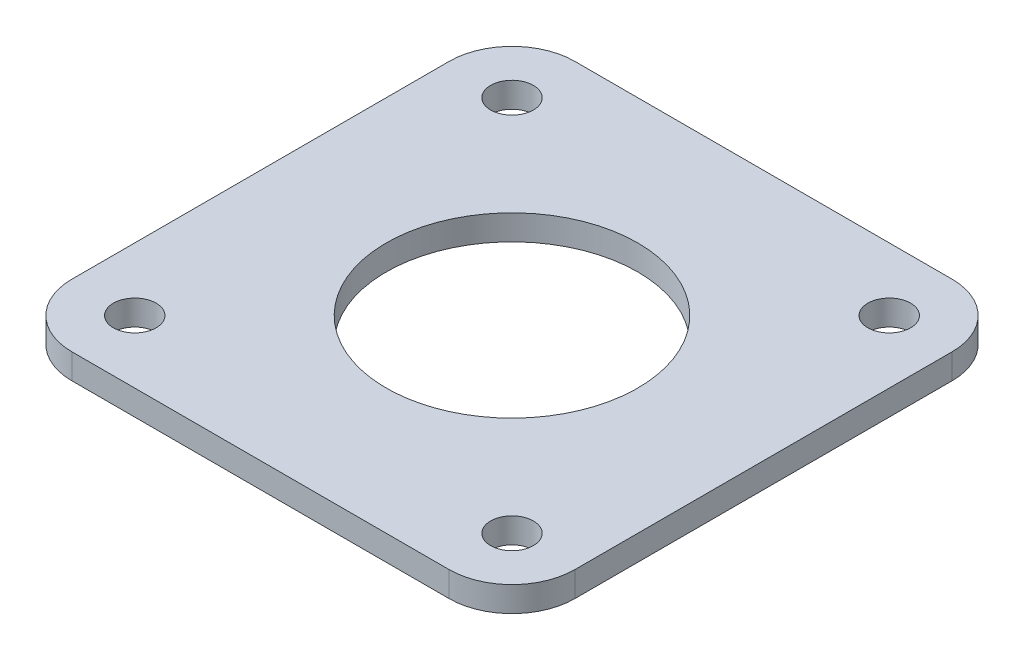
ISO-10303-21;
HEADER;
FILE_DESCRIPTION(('STEP AP214'),'2;1');
FILE_NAME('part.step','',(''),(''),'','','');
FILE_SCHEMA(('AUTOMOTIVE_DESIGN { 1 0 10303 214 1 1 1 1 }'));
ENDSEC;
DATA;
#1=APPLICATION_CONTEXT('core data for automotive mechanical design processes');
#2=APPLICATION_PROTOCOL_DEFINITION('international standard','automotive_design',2000,#1);
#3=PRODUCT_CONTEXT('',#1,'mechanical');
#4=PRODUCT('Part','Part','',(#3));
#5=PRODUCT_RELATED_PRODUCT_CATEGORY('part','',(#4));
#6=PRODUCT_DEFINITION_FORMATION('','',#4);
#7=PRODUCT_DEFINITION_CONTEXT('part definition',#1,'design');
#8=PRODUCT_DEFINITION('design','',#6,#7);
#9=PRODUCT_DEFINITION_SHAPE('','',#8);
#10=(LENGTH_UNIT() NAMED_UNIT(*) SI_UNIT(.MILLI.,.METRE.));
#11=(NAMED_UNIT(*) PLANE_ANGLE_UNIT() SI_UNIT($,.RADIAN.));
#12=(NAMED_UNIT(*) SI_UNIT($,.STERADIAN.) SOLID_ANGLE_UNIT());
#13=UNCERTAINTY_MEASURE_WITH_UNIT(LENGTH_MEASURE(1.E-05),#10,'distance_accuracy_value','');
#14=(GEOMETRIC_REPRESENTATION_CONTEXT(3) GLOBAL_UNCERTAINTY_ASSIGNED_CONTEXT((#13)) GLOBAL_UNIT_ASSIGNED_CONTEXT((#10,
#11,#12)) REPRESENTATION_CONTEXT('',''));
#15=CARTESIAN_POINT('',(0.,0.,0.));
#16=DIRECTION('',(0.,0.,1.));
#17=DIRECTION('',(1.,0.,0.));
#18=AXIS2_PLACEMENT_3D('',#15,#16,#17);
#19=CARTESIAN_POINT('',(-15.,-5.,-15.));
#20=DIRECTION('',(0.,-1.,0.));
#21=DIRECTION('',(0.,0.,-1.));
#22=AXIS2_PLACEMENT_3D('',#19,#20,#21);
#23=PLANE('',#22);
#24=CARTESIAN_POINT('',(-15.,-5.,15.));
#25=DIRECTION('',(0.,-1.,0.));
#26=DIRECTION('',(0.,0.,-1.));
#27=AXIS2_PLACEMENT_3D('',#24,#25,#26);
#28=CIRCLE('',#27,1.7);
#29=CARTESIAN_POINT('',(-15.,-5.,13.3));
#30=VERTEX_POINT('',#29);
#31=EDGE_CURVE('E194',#30,#30,#28,.T.);
#32=ORIENTED_EDGE('',*,*,#31,.F.);
#33=EDGE_LOOP('',(#32));
#34=FACE_BOUND('',#33,.T.);
#35=CARTESIAN_POINT('',(-15.,-5.,-15.));
#36=DIRECTION('',(0.,-1.,0.));
#37=DIRECTION('',(0.,0.,-1.));
#38=AXIS2_PLACEMENT_3D('',#35,#36,#37);
#39=CIRCLE('',#38,1.7);
#40=CARTESIAN_POINT('',(-15.,-5.,-16.7));
#41=VERTEX_POINT('',#40);
#42=EDGE_CURVE('E182',#41,#41,#39,.T.);
#43=ORIENTED_EDGE('',*,*,#42,.F.);
#44=EDGE_LOOP('',(#43));
#45=FACE_BOUND('',#44,.T.);
#46=CARTESIAN_POINT('',(-15.,-5.,-15.));
#47=DIRECTION('',(0.,-1.,0.));
#48=DIRECTION('',(0.,0.,-1.));
#49=AXIS2_PLACEMENT_3D('',#46,#47,#48);
#50=CIRCLE('',#49,5.);
#51=CARTESIAN_POINT('',(-20.,-5.,-15.));
#52=VERTEX_POINT('',#51);
#53=CARTESIAN_POINT('',(-15.,-5.,-20.));
#54=VERTEX_POINT('',#53);
#55=EDGE_CURVE('E145',#52,#54,#50,.T.);
#56=ORIENTED_EDGE('',*,*,#55,.T.);
#57=DIRECTION('',(1.,0.,0.));
#58=VECTOR('',#57,1.);
#59=CARTESIAN_POINT('',(-15.,-5.,-20.));
#60=LINE('',#59,#58);
#61=CARTESIAN_POINT('',(15.,-5.,-20.));
#62=VERTEX_POINT('',#61);
#63=EDGE_CURVE('E93',#54,#62,#60,.T.);
#64=ORIENTED_EDGE('',*,*,#63,.T.);
#65=CARTESIAN_POINT('',(15.,-5.,-15.));
#66=DIRECTION('',(0.,-1.,0.));
#67=DIRECTION('',(0.,0.,-1.));
#68=AXIS2_PLACEMENT_3D('',#65,#66,#67);
#69=CIRCLE('',#68,5.);
#70=CARTESIAN_POINT('',(20.,-5.,-15.));
#71=VERTEX_POINT('',#70);
#72=EDGE_CURVE('E160',#62,#71,#69,.T.);
#73=ORIENTED_EDGE('',*,*,#72,.T.);
#74=DIRECTION('',(0.,0.,1.));
#75=VECTOR('',#74,1.);
#76=CARTESIAN_POINT('',(20.,-5.,-15.));
#77=LINE('',#76,#75);
#78=CARTESIAN_POINT('',(20.,-5.,15.));
#79=VERTEX_POINT('',#78);
#80=EDGE_CURVE('E173',#71,#79,#77,.T.);
#81=ORIENTED_EDGE('',*,*,#80,.T.);
#82=CARTESIAN_POINT('',(15.,-5.,15.));
#83=DIRECTION('',(0.,-1.,0.));
#84=DIRECTION('',(0.,0.,-1.));
#85=AXIS2_PLACEMENT_3D('',#82,#83,#84);
#86=CIRCLE('',#85,5.);
#87=CARTESIAN_POINT('',(15.,-5.,20.));
#88=VERTEX_POINT('',#87);
#89=EDGE_CURVE('E112',#79,#88,#86,.T.);
#90=ORIENTED_EDGE('',*,*,#89,.T.);
#91=DIRECTION('',(-1.,0.,0.));
#92=VECTOR('',#91,1.);
#93=CARTESIAN_POINT('',(15.,-5.,20.));
#94=LINE('',#93,#92);
#95=CARTESIAN_POINT('',(-15.,-5.,20.));
#96=VERTEX_POINT('',#95);
#97=EDGE_CURVE('E106',#88,#96,#94,.T.);
#98=ORIENTED_EDGE('',*,*,#97,.T.);
#99=CARTESIAN_POINT('',(-15.,-5.,15.));
#100=DIRECTION('',(0.,-1.,0.));
#101=DIRECTION('',(0.,0.,-1.));
#102=AXIS2_PLACEMENT_3D('',#99,#100,#101);
#103=CIRCLE('',#102,5.);
#104=CARTESIAN_POINT('',(-20.,-5.,15.));
#105=VERTEX_POINT('',#104);
#106=EDGE_CURVE('E110',#96,#105,#103,.T.);
#107=ORIENTED_EDGE('',*,*,#106,.T.);
#108=DIRECTION('',(0.,0.,-1.));
#109=VECTOR('',#108,1.);
#110=CARTESIAN_POINT('',(-20.,-5.,15.));
#111=LINE('',#110,#109);
#112=EDGE_CURVE('E50',#105,#52,#111,.T.);
#113=ORIENTED_EDGE('',*,*,#112,.T.);
#114=EDGE_LOOP('',(#56,#64,#73,#81,#90,#98,#107,#113));
#115=FACE_BOUND('',#114,.T.);
#116=CARTESIAN_POINT('',(15.,-5.,-15.));
#117=DIRECTION('',(0.,-1.,0.));
#118=DIRECTION('',(0.,0.,-1.));
#119=AXIS2_PLACEMENT_3D('',#116,#117,#118);
#120=CIRCLE('',#119,1.7);
#121=CARTESIAN_POINT('',(15.,-5.,-16.7));
#122=VERTEX_POINT('',#121);
#123=EDGE_CURVE('E134',#122,#122,#120,.T.);
#124=ORIENTED_EDGE('',*,*,#123,.F.);
#125=EDGE_LOOP('',(#124));
#126=FACE_BOUND('',#125,.T.);
#127=CARTESIAN_POINT('',(15.,-5.,15.));
#128=DIRECTION('',(0.,-1.,0.));
#129=DIRECTION('',(0.,0.,-1.));
#130=AXIS2_PLACEMENT_3D('',#127,#128,#129);
#131=CIRCLE('',#130,1.7);
#132=CARTESIAN_POINT('',(15.,-5.,13.3));
#133=VERTEX_POINT('',#132);
#134=EDGE_CURVE('E188',#133,#133,#131,.T.);
#135=ORIENTED_EDGE('',*,*,#134,.F.);
#136=EDGE_LOOP('',(#135));
#137=FACE_BOUND('',#136,.T.);
#138=CARTESIAN_POINT('',(0.,-5.,0.));
#139=DIRECTION('',(0.,-1.,0.));
#140=DIRECTION('',(0.,0.,-1.));
#141=AXIS2_PLACEMENT_3D('',#138,#139,#140);
#142=CIRCLE('',#141,10.);
#143=CARTESIAN_POINT('',(0.,-5.,-10.));
#144=VERTEX_POINT('',#143);
#145=EDGE_CURVE('E200',#144,#144,#142,.T.);
#146=ORIENTED_EDGE('',*,*,#145,.F.);
#147=EDGE_LOOP('',(#146));
#148=FACE_BOUND('',#147,.T.);
#149=ADVANCED_FACE('F33',(#34,#45,#115,#126,#137,#148),#23,.T.);
#150=CARTESIAN_POINT('',(-15.,-3.,-15.));
#151=DIRECTION('',(0.,-1.,0.));
#152=DIRECTION('',(0.,0.,-1.));
#153=AXIS2_PLACEMENT_3D('',#150,#151,#152);
#154=PLANE('',#153);
#155=CARTESIAN_POINT('',(-15.,-3.,-15.));
#156=DIRECTION('',(0.,-1.,0.));
#157=DIRECTION('',(0.,0.,-1.));
#158=AXIS2_PLACEMENT_3D('',#155,#156,#157);
#159=CIRCLE('',#158,5.);
#160=CARTESIAN_POINT('',(-20.,-3.,-15.));
#161=VERTEX_POINT('',#160);
#162=CARTESIAN_POINT('',(-15.,-3.,-20.));
#163=VERTEX_POINT('',#162);
#164=EDGE_CURVE('E130',#161,#163,#159,.T.);
#165=ORIENTED_EDGE('',*,*,#164,.F.);
#166=DIRECTION('',(0.,0.,-1.));
#167=VECTOR('',#166,1.);
#168=CARTESIAN_POINT('',(-20.,-3.,15.));
#169=LINE('',#168,#167);
#170=CARTESIAN_POINT('',(-20.,-3.,15.));
#171=VERTEX_POINT('',#170);
#172=EDGE_CURVE('E85',#171,#161,#169,.T.);
#173=ORIENTED_EDGE('',*,*,#172,.F.);
#174=CARTESIAN_POINT('',(-15.,-3.,15.));
#175=DIRECTION('',(0.,-1.,0.));
#176=DIRECTION('',(0.,0.,-1.));
#177=AXIS2_PLACEMENT_3D('',#174,#175,#176);
#178=CIRCLE('',#177,5.);
#179=CARTESIAN_POINT('',(-15.,-3.,20.));
#180=VERTEX_POINT('',#179);
#181=EDGE_CURVE('E79',#180,#171,#178,.T.);
#182=ORIENTED_EDGE('',*,*,#181,.F.);
#183=DIRECTION('',(-1.,0.,0.));
#184=VECTOR('',#183,1.);
#185=CARTESIAN_POINT('',(15.,-3.,20.));
#186=LINE('',#185,#184);
#187=CARTESIAN_POINT('',(15.,-3.,20.));
#188=VERTEX_POINT('',#187);
#189=EDGE_CURVE('E120',#188,#180,#186,.T.);
#190=ORIENTED_EDGE('',*,*,#189,.F.);
#191=CARTESIAN_POINT('',(15.,-3.,15.));
#192=DIRECTION('',(0.,-1.,0.));
#193=DIRECTION('',(0.,0.,-1.));
#194=AXIS2_PLACEMENT_3D('',#191,#192,#193);
#195=CIRCLE('',#194,5.);
#196=CARTESIAN_POINT('',(20.,-3.,15.));
#197=VERTEX_POINT('',#196);
#198=EDGE_CURVE('E140',#197,#188,#195,.T.);
#199=ORIENTED_EDGE('',*,*,#198,.F.);
#200=DIRECTION('',(0.,0.,1.));
#201=VECTOR('',#200,1.);
#202=CARTESIAN_POINT('',(20.,-3.,-15.));
#203=LINE('',#202,#201);
#204=CARTESIAN_POINT('',(20.,-3.,-15.));
#205=VERTEX_POINT('',#204);
#206=EDGE_CURVE('E138',#205,#197,#203,.T.);
#207=ORIENTED_EDGE('',*,*,#206,.F.);
#208=CARTESIAN_POINT('',(15.,-3.,-15.));
#209=DIRECTION('',(0.,-1.,0.));
#210=DIRECTION('',(0.,0.,-1.));
#211=AXIS2_PLACEMENT_3D('',#208,#209,#210);
#212=CIRCLE('',#211,5.);
#213=CARTESIAN_POINT('',(15.,-3.,-20.));
#214=VERTEX_POINT('',#213);
#215=EDGE_CURVE('E136',#214,#205,#212,.T.);
#216=ORIENTED_EDGE('',*,*,#215,.F.);
#217=DIRECTION('',(1.,0.,0.));
#218=VECTOR('',#217,1.);
#219=CARTESIAN_POINT('',(-15.,-3.,-20.));
#220=LINE('',#219,#218);
#221=EDGE_CURVE('E133',#163,#214,#220,.T.);
#222=ORIENTED_EDGE('',*,*,#221,.F.);
#223=EDGE_LOOP('',(#165,#173,#182,#190,#199,#207,#216,#222));
#224=FACE_BOUND('',#223,.T.);
#225=CARTESIAN_POINT('',(15.,-3.,-15.));
#226=DIRECTION('',(0.,-1.,0.));
#227=DIRECTION('',(0.,0.,-1.));
#228=AXIS2_PLACEMENT_3D('',#225,#226,#227);
#229=CIRCLE('',#228,1.7);
#230=CARTESIAN_POINT('',(15.,-3.,-16.7));
#231=VERTEX_POINT('',#230);
#232=EDGE_CURVE('E179',#231,#231,#229,.T.);
#233=ORIENTED_EDGE('',*,*,#232,.T.);
#234=EDGE_LOOP('',(#233));
#235=FACE_BOUND('',#234,.T.);
#236=CARTESIAN_POINT('',(-15.,-3.,-15.));
#237=DIRECTION('',(0.,-1.,0.));
#238=DIRECTION('',(0.,0.,-1.));
#239=AXIS2_PLACEMENT_3D('',#236,#237,#238);
#240=CIRCLE('',#239,1.7);
#241=CARTESIAN_POINT('',(-15.,-3.,-16.7));
#242=VERTEX_POINT('',#241);
#243=EDGE_CURVE('E185',#242,#242,#240,.T.);
#244=ORIENTED_EDGE('',*,*,#243,.T.);
#245=EDGE_LOOP('',(#244));
#246=FACE_BOUND('',#245,.T.);
#247=CARTESIAN_POINT('',(15.,-3.,15.));
#248=DIRECTION('',(0.,-1.,0.));
#249=DIRECTION('',(0.,0.,-1.));
#250=AXIS2_PLACEMENT_3D('',#247,#248,#249);
#251=CIRCLE('',#250,1.7);
#252=CARTESIAN_POINT('',(15.,-3.,13.3));
#253=VERTEX_POINT('',#252);
#254=EDGE_CURVE('E191',#253,#253,#251,.T.);
#255=ORIENTED_EDGE('',*,*,#254,.T.);
#256=EDGE_LOOP('',(#255));
#257=FACE_BOUND('',#256,.T.);
#258=CARTESIAN_POINT('',(-15.,-3.,15.));
#259=DIRECTION('',(0.,-1.,0.));
#260=DIRECTION('',(0.,0.,-1.));
#261=AXIS2_PLACEMENT_3D('',#258,#259,#260);
#262=CIRCLE('',#261,1.7);
#263=CARTESIAN_POINT('',(-15.,-3.,13.3));
#264=VERTEX_POINT('',#263);
#265=EDGE_CURVE('E197',#264,#264,#262,.T.);
#266=ORIENTED_EDGE('',*,*,#265,.T.);
#267=EDGE_LOOP('',(#266));
#268=FACE_BOUND('',#267,.T.);
#269=CARTESIAN_POINT('',(0.,-3.,0.));
#270=DIRECTION('',(0.,-1.,0.));
#271=DIRECTION('',(0.,0.,-1.));
#272=AXIS2_PLACEMENT_3D('',#269,#270,#271);
#273=CIRCLE('',#272,10.);
#274=CARTESIAN_POINT('',(0.,-3.,-10.));
#275=VERTEX_POINT('',#274);
#276=EDGE_CURVE('E203',#275,#275,#273,.T.);
#277=ORIENTED_EDGE('',*,*,#276,.T.);
#278=EDGE_LOOP('',(#277));
#279=FACE_BOUND('',#278,.T.);
#280=ADVANCED_FACE('F164',(#224,#235,#246,#257,#268,#279),#154,.F.);
#281=CARTESIAN_POINT('',(-15.,-5.,-15.));
#282=DIRECTION('',(0.,1.,0.));
#283=DIRECTION('',(0.,0.,1.));
#284=AXIS2_PLACEMENT_3D('',#281,#282,#283);
#285=CYLINDRICAL_SURFACE('',#284,5.);
#286=ORIENTED_EDGE('',*,*,#164,.T.);
#287=DIRECTION('',(0.,1.,0.));
#288=VECTOR('',#287,1.);
#289=CARTESIAN_POINT('',(-15.,-5.,-20.));
#290=LINE('',#289,#288);
#291=EDGE_CURVE('E11',#54,#163,#290,.T.);
#292=ORIENTED_EDGE('',*,*,#291,.F.);
#293=ORIENTED_EDGE('',*,*,#55,.F.);
#294=DIRECTION('',(0.,1.,0.));
#295=VECTOR('',#294,1.);
#296=CARTESIAN_POINT('',(-20.,-5.,-15.));
#297=LINE('',#296,#295);
#298=EDGE_CURVE('E126',#52,#161,#297,.T.);
#299=ORIENTED_EDGE('',*,*,#298,.T.);
#300=EDGE_LOOP('',(#286,#292,#293,#299));
#301=FACE_BOUND('',#300,.T.);
#302=ADVANCED_FACE('F35',(#301),#285,.T.);
#303=CARTESIAN_POINT('',(-15.,-5.,-20.));
#304=DIRECTION('',(0.,0.,1.));
#305=DIRECTION('',(1.,0.,0.));
#306=AXIS2_PLACEMENT_3D('',#303,#304,#305);
#307=PLANE('',#306);
#308=ORIENTED_EDGE('',*,*,#221,.T.);
#309=DIRECTION('',(0.,1.,0.));
#310=VECTOR('',#309,1.);
#311=CARTESIAN_POINT('',(15.,-5.,-20.));
#312=LINE('',#311,#310);
#313=EDGE_CURVE('E42',#62,#214,#312,.T.);
#314=ORIENTED_EDGE('',*,*,#313,.F.);
#315=ORIENTED_EDGE('',*,*,#63,.F.);
#316=ORIENTED_EDGE('',*,*,#291,.T.);
#317=EDGE_LOOP('',(#308,#314,#315,#316));
#318=FACE_BOUND('',#317,.T.);
#319=ADVANCED_FACE('F237',(#318),#307,.F.);
#320=CARTESIAN_POINT('',(15.,-5.,-15.));
#321=DIRECTION('',(0.,1.,0.));
#322=DIRECTION('',(0.,0.,1.));
#323=AXIS2_PLACEMENT_3D('',#320,#321,#322);
#324=CYLINDRICAL_SURFACE('',#323,5.);
#325=ORIENTED_EDGE('',*,*,#215,.T.);
#326=DIRECTION('',(0.,1.,0.));
#327=VECTOR('',#326,1.);
#328=CARTESIAN_POINT('',(20.,-5.,-15.));
#329=LINE('',#328,#327);
#330=EDGE_CURVE('E152',#71,#205,#329,.T.);
#331=ORIENTED_EDGE('',*,*,#330,.F.);
#332=ORIENTED_EDGE('',*,*,#72,.F.);
#333=ORIENTED_EDGE('',*,*,#313,.T.);
#334=EDGE_LOOP('',(#325,#331,#332,#333));
#335=FACE_BOUND('',#334,.T.);
#336=ADVANCED_FACE('F158',(#335),#324,.T.);
#337=CARTESIAN_POINT('',(20.,-5.,-15.));
#338=DIRECTION('',(-1.,0.,0.));
#339=DIRECTION('',(0.,0.,1.));
#340=AXIS2_PLACEMENT_3D('',#337,#338,#339);
#341=PLANE('',#340);
#342=ORIENTED_EDGE('',*,*,#206,.T.);
#343=DIRECTION('',(0.,1.,0.));
#344=VECTOR('',#343,1.);
#345=CARTESIAN_POINT('',(20.,-5.,15.));
#346=LINE('',#345,#344);
#347=EDGE_CURVE('E149',#79,#197,#346,.T.);
#348=ORIENTED_EDGE('',*,*,#347,.F.);
#349=ORIENTED_EDGE('',*,*,#80,.F.);
#350=ORIENTED_EDGE('',*,*,#330,.T.);
#351=EDGE_LOOP('',(#342,#348,#349,#350));
#352=FACE_BOUND('',#351,.T.);
#353=ADVANCED_FACE('F169',(#352),#341,.F.);
#354=CARTESIAN_POINT('',(15.,-5.,15.));
#355=DIRECTION('',(0.,1.,0.));
#356=DIRECTION('',(0.,0.,1.));
#357=AXIS2_PLACEMENT_3D('',#354,#355,#356);
#358=CYLINDRICAL_SURFACE('',#357,5.);
#359=ORIENTED_EDGE('',*,*,#198,.T.);
#360=DIRECTION('',(0.,1.,0.));
#361=VECTOR('',#360,1.);
#362=CARTESIAN_POINT('',(15.,-5.,20.));
#363=LINE('',#362,#361);
#364=EDGE_CURVE('E121',#88,#188,#363,.T.);
#365=ORIENTED_EDGE('',*,*,#364,.F.);
#366=ORIENTED_EDGE('',*,*,#89,.F.);
#367=ORIENTED_EDGE('',*,*,#347,.T.);
#368=EDGE_LOOP('',(#359,#365,#366,#367));
#369=FACE_BOUND('',#368,.T.);
#370=ADVANCED_FACE('F172',(#369),#358,.T.);
#371=CARTESIAN_POINT('',(15.,-5.,20.));
#372=DIRECTION('',(0.,0.,-1.));
#373=DIRECTION('',(-1.,0.,0.));
#374=AXIS2_PLACEMENT_3D('',#371,#372,#373);
#375=PLANE('',#374);
#376=ORIENTED_EDGE('',*,*,#189,.T.);
#377=DIRECTION('',(0.,1.,0.));
#378=VECTOR('',#377,1.);
#379=CARTESIAN_POINT('',(-15.,-5.,20.));
#380=LINE('',#379,#378);
#381=EDGE_CURVE('E117',#96,#180,#380,.T.);
#382=ORIENTED_EDGE('',*,*,#381,.F.);
#383=ORIENTED_EDGE('',*,*,#97,.F.);
#384=ORIENTED_EDGE('',*,*,#364,.T.);
#385=EDGE_LOOP('',(#376,#382,#383,#384));
#386=FACE_BOUND('',#385,.T.);
#387=ADVANCED_FACE('F118',(#386),#375,.F.);
#388=CARTESIAN_POINT('',(-15.,-5.,15.));
#389=DIRECTION('',(0.,1.,0.));
#390=DIRECTION('',(0.,0.,1.));
#391=AXIS2_PLACEMENT_3D('',#388,#389,#390);
#392=CYLINDRICAL_SURFACE('',#391,5.);
#393=ORIENTED_EDGE('',*,*,#181,.T.);
#394=DIRECTION('',(0.,1.,0.));
#395=VECTOR('',#394,1.);
#396=CARTESIAN_POINT('',(-20.,-5.,15.));
#397=LINE('',#396,#395);
#398=EDGE_CURVE('E122',#105,#171,#397,.T.);
#399=ORIENTED_EDGE('',*,*,#398,.F.);
#400=ORIENTED_EDGE('',*,*,#106,.F.);
#401=ORIENTED_EDGE('',*,*,#381,.T.);
#402=EDGE_LOOP('',(#393,#399,#400,#401));
#403=FACE_BOUND('',#402,.T.);
#404=ADVANCED_FACE('F124',(#403),#392,.T.);
#405=CARTESIAN_POINT('',(-20.,-5.,15.));
#406=DIRECTION('',(1.,0.,0.));
#407=DIRECTION('',(0.,0.,-1.));
#408=AXIS2_PLACEMENT_3D('',#405,#406,#407);
#409=PLANE('',#408);
#410=ORIENTED_EDGE('',*,*,#172,.T.);
#411=ORIENTED_EDGE('',*,*,#298,.F.);
#412=ORIENTED_EDGE('',*,*,#112,.F.);
#413=ORIENTED_EDGE('',*,*,#398,.T.);
#414=EDGE_LOOP('',(#410,#411,#412,#413));
#415=FACE_BOUND('',#414,.T.);
#416=ADVANCED_FACE('F225',(#415),#409,.F.);
#417=CARTESIAN_POINT('',(15.,-5.,-15.));
#418=DIRECTION('',(0.,1.,0.));
#419=DIRECTION('',(0.,0.,1.));
#420=AXIS2_PLACEMENT_3D('',#417,#418,#419);
#421=CYLINDRICAL_SURFACE('',#420,1.7);
#422=ORIENTED_EDGE('',*,*,#123,.T.);
#423=EDGE_LOOP('',(#422));
#424=FACE_BOUND('',#423,.T.);
#425=ORIENTED_EDGE('',*,*,#232,.F.);
#426=EDGE_LOOP('',(#425));
#427=FACE_BOUND('',#426,.T.);
#428=ADVANCED_FACE('F222',(#424,#427),#421,.F.);
#429=CARTESIAN_POINT('',(-15.,-5.,-15.));
#430=DIRECTION('',(0.,1.,0.));
#431=DIRECTION('',(0.,0.,1.));
#432=AXIS2_PLACEMENT_3D('',#429,#430,#431);
#433=CYLINDRICAL_SURFACE('',#432,1.7);
#434=ORIENTED_EDGE('',*,*,#42,.T.);
#435=EDGE_LOOP('',(#434));
#436=FACE_BOUND('',#435,.T.);
#437=ORIENTED_EDGE('',*,*,#243,.F.);
#438=EDGE_LOOP('',(#437));
#439=FACE_BOUND('',#438,.T.);
#440=ADVANCED_FACE('F301',(#436,#439),#433,.F.);
#441=CARTESIAN_POINT('',(15.,-5.,15.));
#442=DIRECTION('',(0.,1.,0.));
#443=DIRECTION('',(0.,0.,1.));
#444=AXIS2_PLACEMENT_3D('',#441,#442,#443);
#445=CYLINDRICAL_SURFACE('',#444,1.7);
#446=ORIENTED_EDGE('',*,*,#134,.T.);
#447=EDGE_LOOP('',(#446));
#448=FACE_BOUND('',#447,.T.);
#449=ORIENTED_EDGE('',*,*,#254,.F.);
#450=EDGE_LOOP('',(#449));
#451=FACE_BOUND('',#450,.T.);
#452=ADVANCED_FACE('F309',(#448,#451),#445,.F.);
#453=CARTESIAN_POINT('',(-15.,-5.,15.));
#454=DIRECTION('',(0.,1.,0.));
#455=DIRECTION('',(0.,0.,1.));
#456=AXIS2_PLACEMENT_3D('',#453,#454,#455);
#457=CYLINDRICAL_SURFACE('',#456,1.7);
#458=ORIENTED_EDGE('',*,*,#31,.T.);
#459=EDGE_LOOP('',(#458));
#460=FACE_BOUND('',#459,.T.);
#461=ORIENTED_EDGE('',*,*,#265,.F.);
#462=EDGE_LOOP('',(#461));
#463=FACE_BOUND('',#462,.T.);
#464=ADVANCED_FACE('F317',(#460,#463),#457,.F.);
#465=CARTESIAN_POINT('',(0.,-5.,0.));
#466=DIRECTION('',(0.,1.,0.));
#467=DIRECTION('',(0.,0.,1.));
#468=AXIS2_PLACEMENT_3D('',#465,#466,#467);
#469=CYLINDRICAL_SURFACE('',#468,10.);
#470=ORIENTED_EDGE('',*,*,#145,.T.);
#471=EDGE_LOOP('',(#470));
#472=FACE_BOUND('',#471,.T.);
#473=ORIENTED_EDGE('',*,*,#276,.F.);
#474=EDGE_LOOP('',(#473));
#475=FACE_BOUND('',#474,.T.);
#476=ADVANCED_FACE('F209',(#472,#475),#469,.F.);
#477=CLOSED_SHELL('',(#149,#280,#302,#319,#336,#353,#370,#387,#404,#416,#428,#440,#452,#464,#476));
#478=MANIFOLD_SOLID_BREP('B2',#477);
#479=ADVANCED_BREP_SHAPE_REPRESENTATION('',(#18,#478),#14);
#480=SHAPE_DEFINITION_REPRESENTATION(#9,#479);
ENDSEC;
END-ISO-10303-21;
